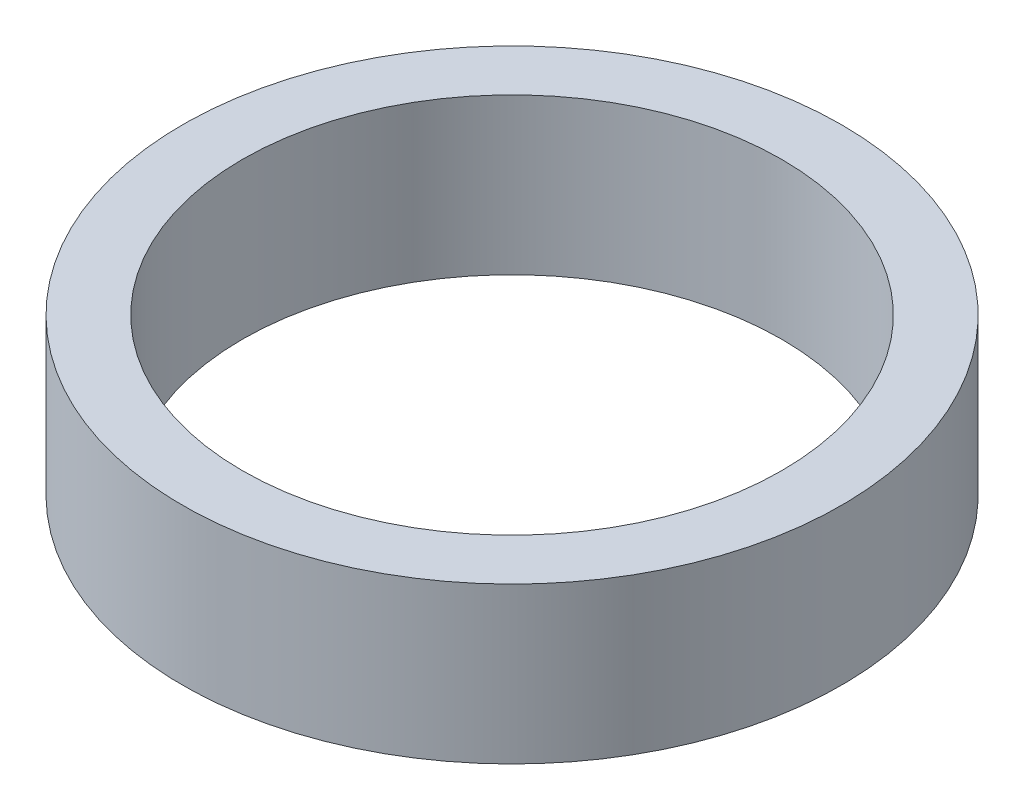
ISO-10303-21;
HEADER;
FILE_DESCRIPTION(('STEP AP214'),'2;1');
FILE_NAME('part.step','',(''),(''),'','','');
FILE_SCHEMA(('AUTOMOTIVE_DESIGN { 1 0 10303 214 1 1 1 1 }'));
ENDSEC;
DATA;
#1=APPLICATION_CONTEXT('core data for automotive mechanical design processes');
#2=APPLICATION_PROTOCOL_DEFINITION('international standard','automotive_design',2000,#1);
#3=PRODUCT_CONTEXT('',#1,'mechanical');
#4=PRODUCT('Part','Part','',(#3));
#5=PRODUCT_RELATED_PRODUCT_CATEGORY('part','',(#4));
#6=PRODUCT_DEFINITION_FORMATION('','',#4);
#7=PRODUCT_DEFINITION_CONTEXT('part definition',#1,'design');
#8=PRODUCT_DEFINITION('design','',#6,#7);
#9=PRODUCT_DEFINITION_SHAPE('','',#8);
#10=(LENGTH_UNIT() NAMED_UNIT(*) SI_UNIT(.MILLI.,.METRE.));
#11=(NAMED_UNIT(*) PLANE_ANGLE_UNIT() SI_UNIT($,.RADIAN.));
#12=(NAMED_UNIT(*) SI_UNIT($,.STERADIAN.) SOLID_ANGLE_UNIT());
#13=UNCERTAINTY_MEASURE_WITH_UNIT(LENGTH_MEASURE(1.E-05),#10,'distance_accuracy_value','');
#14=(GEOMETRIC_REPRESENTATION_CONTEXT(3) GLOBAL_UNCERTAINTY_ASSIGNED_CONTEXT((#13)) GLOBAL_UNIT_ASSIGNED_CONTEXT((#10,
#11,#12)) REPRESENTATION_CONTEXT('',''));
#15=CARTESIAN_POINT('',(0.,0.,0.));
#16=DIRECTION('',(0.,0.,1.));
#17=DIRECTION('',(1.,0.,0.));
#18=AXIS2_PLACEMENT_3D('',#15,#16,#17);
#19=CARTESIAN_POINT('',(0.,26.,0.));
#20=DIRECTION('',(0.,-1.,0.));
#21=DIRECTION('',(0.,0.,-1.));
#22=AXIS2_PLACEMENT_3D('',#19,#20,#21);
#23=CYLINDRICAL_SURFACE('',#22,55.);
#24=CARTESIAN_POINT('',(0.,26.,0.));
#25=DIRECTION('',(0.,1.,0.));
#26=DIRECTION('',(0.,0.,1.));
#27=AXIS2_PLACEMENT_3D('',#24,#25,#26);
#28=CIRCLE('',#27,55.);
#29=CARTESIAN_POINT('',(0.,26.,-55.));
#30=VERTEX_POINT('',#29);
#31=EDGE_CURVE('E10',#30,#30,#28,.T.);
#32=CARTESIAN_POINT('',(0.,0.,0.));
#33=DIRECTION('',(0.,1.,0.));
#34=DIRECTION('',(0.,0.,1.));
#35=AXIS2_PLACEMENT_3D('',#32,#33,#34);
#36=CIRCLE('',#35,55.);
#37=CARTESIAN_POINT('',(0.,0.,-55.));
#38=VERTEX_POINT('',#37);
#39=EDGE_CURVE('E37',#38,#38,#36,.T.);
#40=CARTESIAN_POINT('',(0.,26.,-55.));
#41=CARTESIAN_POINT('',(0.,25.7291666666667,-55.));
#42=CARTESIAN_POINT('',(0.,25.4583333333333,-55.));
#43=CARTESIAN_POINT('',(0.,24.9166666666667,-55.));
#44=CARTESIAN_POINT('',(0.,24.6458333333333,-55.));
#45=CARTESIAN_POINT('',(0.,24.1041666666667,-55.));
#46=CARTESIAN_POINT('',(0.,23.8333333333333,-55.));
#47=CARTESIAN_POINT('',(0.,23.2916666666667,-55.));
#48=CARTESIAN_POINT('',(0.,23.0208333333333,-55.));
#49=CARTESIAN_POINT('',(0.,22.4791666666667,-55.));
#50=CARTESIAN_POINT('',(0.,22.2083333333333,-55.));
#51=CARTESIAN_POINT('',(0.,21.6666666666667,-55.));
#52=CARTESIAN_POINT('',(0.,21.3958333333333,-55.));
#53=CARTESIAN_POINT('',(0.,20.8541666666667,-55.));
#54=CARTESIAN_POINT('',(0.,20.5833333333333,-55.));
#55=CARTESIAN_POINT('',(0.,20.0416666666667,-55.));
#56=CARTESIAN_POINT('',(0.,19.7708333333333,-55.));
#57=CARTESIAN_POINT('',(0.,19.2291666666667,-55.));
#58=CARTESIAN_POINT('',(0.,18.9583333333333,-55.));
#59=CARTESIAN_POINT('',(0.,18.4166666666667,-55.));
#60=CARTESIAN_POINT('',(0.,18.1458333333333,-55.));
#61=CARTESIAN_POINT('',(0.,17.6041666666667,-55.));
#62=CARTESIAN_POINT('',(0.,17.3333333333333,-55.));
#63=CARTESIAN_POINT('',(0.,16.7916666666667,-55.));
#64=CARTESIAN_POINT('',(0.,16.5208333333333,-55.));
#65=CARTESIAN_POINT('',(0.,15.9791666666667,-55.));
#66=CARTESIAN_POINT('',(0.,15.7083333333333,-55.));
#67=CARTESIAN_POINT('',(0.,15.1666666666667,-55.));
#68=CARTESIAN_POINT('',(0.,14.8958333333333,-55.));
#69=CARTESIAN_POINT('',(0.,14.3541666666667,-55.));
#70=CARTESIAN_POINT('',(0.,14.0833333333333,-55.));
#71=CARTESIAN_POINT('',(0.,13.5416666666667,-55.));
#72=CARTESIAN_POINT('',(0.,13.2708333333333,-55.));
#73=CARTESIAN_POINT('',(0.,12.7291666666667,-55.));
#74=CARTESIAN_POINT('',(0.,12.4583333333333,-55.));
#75=CARTESIAN_POINT('',(0.,11.9166666666667,-55.));
#76=CARTESIAN_POINT('',(0.,11.6458333333333,-55.));
#77=CARTESIAN_POINT('',(0.,11.1041666666667,-55.));
#78=CARTESIAN_POINT('',(0.,10.8333333333333,-55.));
#79=CARTESIAN_POINT('',(0.,10.2916666666667,-55.));
#80=CARTESIAN_POINT('',(0.,10.0208333333333,-55.));
#81=CARTESIAN_POINT('',(0.,9.47916666666667,-55.));
#82=CARTESIAN_POINT('',(0.,9.20833333333333,-55.));
#83=CARTESIAN_POINT('',(0.,8.66666666666667,-55.));
#84=CARTESIAN_POINT('',(0.,8.39583333333333,-55.));
#85=CARTESIAN_POINT('',(0.,7.85416666666667,-55.));
#86=CARTESIAN_POINT('',(0.,7.58333333333333,-55.));
#87=CARTESIAN_POINT('',(0.,7.04166666666667,-55.));
#88=CARTESIAN_POINT('',(0.,6.77083333333333,-55.));
#89=CARTESIAN_POINT('',(0.,6.22916666666667,-55.));
#90=CARTESIAN_POINT('',(0.,5.95833333333333,-55.));
#91=CARTESIAN_POINT('',(0.,5.41666666666667,-55.));
#92=CARTESIAN_POINT('',(0.,5.14583333333333,-55.));
#93=CARTESIAN_POINT('',(0.,4.60416666666667,-55.));
#94=CARTESIAN_POINT('',(0.,4.33333333333333,-55.));
#95=CARTESIAN_POINT('',(0.,3.79166666666667,-55.));
#96=CARTESIAN_POINT('',(0.,3.52083333333333,-55.));
#97=CARTESIAN_POINT('',(0.,2.97916666666667,-55.));
#98=CARTESIAN_POINT('',(0.,2.70833333333333,-55.));
#99=CARTESIAN_POINT('',(0.,2.16666666666667,-55.));
#100=CARTESIAN_POINT('',(0.,1.89583333333333,-55.));
#101=CARTESIAN_POINT('',(0.,1.35416666666667,-55.));
#102=CARTESIAN_POINT('',(0.,1.08333333333333,-55.));
#103=CARTESIAN_POINT('',(0.,0.541666666666667,-55.));
#104=CARTESIAN_POINT('',(0.,0.270833333333334,-55.));
#105=CARTESIAN_POINT('',(0.,0.,-55.));
#106=B_SPLINE_CURVE_WITH_KNOTS('',3,(#40,#41,#42,#43,#44,#45,#46,#47,#48,#49,#50,#51,#52,#53,
#54,#55,#56,#57,#58,#59,#60,#61,#62,#63,#64,#65,#66,#67,#68,#69,#70,#71,#72,#73,#74,#75,#76,#77,
#78,#79,#80,#81,#82,#83,#84,#85,#86,#87,#88,#89,#90,#91,#92,#93,#94,#95,#96,#97,#98,#99,#100,
#101,#102,#103,#104,#105),.UNSPECIFIED.,.F.,.F.,(4,2,2,2,2,2,2,2,2,2,2,2,2,2,2,2,2,2,2,2,2,2,2,
2,2,2,2,2,2,2,2,2,4),(0.,0.812500000000001,1.625,2.4375,3.25,4.0625,4.875,5.6875,6.5,7.3125,
8.125,8.9375,9.75,10.5625,11.375,12.1875,13.,13.8125,14.625,15.4375,16.25,17.0625,17.875,
18.6875,19.5,20.3125,21.125,21.9375,22.75,23.5625,24.375,25.1875,26.),.UNSPECIFIED.);
#107=EDGE_CURVE('BSEAM40',#30,#38,#106,.T.);
#108=ORIENTED_EDGE('',*,*,#31,.F.);
#109=ORIENTED_EDGE('',*,*,#39,.T.);
#110=ORIENTED_EDGE('',*,*,#107,.T.);
#111=ORIENTED_EDGE('',*,*,#107,.F.);
#112=EDGE_LOOP('',(#108,#110,#109,#111));
#113=FACE_BOUND('',#112,.T.);
#114=ADVANCED_FACE('F40',(#113),#23,.T.);
#115=CARTESIAN_POINT('',(0.,26.,0.));
#116=DIRECTION('',(0.,1.,0.));
#117=DIRECTION('',(0.,0.,1.));
#118=AXIS2_PLACEMENT_3D('',#115,#116,#117);
#119=PLANE('',#118);
#120=CARTESIAN_POINT('',(0.,26.,0.));
#121=DIRECTION('',(0.,1.,0.));
#122=DIRECTION('',(0.,0.,1.));
#123=AXIS2_PLACEMENT_3D('',#120,#121,#122);
#124=CIRCLE('',#123,45.);
#125=CARTESIAN_POINT('',(0.,26.,-45.));
#126=VERTEX_POINT('',#125);
#127=EDGE_CURVE('E50',#126,#126,#124,.T.);
#128=ORIENTED_EDGE('',*,*,#127,.F.);
#129=EDGE_LOOP('',(#128));
#130=FACE_BOUND('',#129,.T.);
#131=ORIENTED_EDGE('',*,*,#31,.T.);
#132=EDGE_LOOP('',(#131));
#133=FACE_BOUND('',#132,.T.);
#134=ADVANCED_FACE('F59',(#130,#133),#119,.T.);
#135=CARTESIAN_POINT('',(0.,0.,0.));
#136=DIRECTION('',(0.,1.,0.));
#137=DIRECTION('',(0.,0.,1.));
#138=AXIS2_PLACEMENT_3D('',#135,#136,#137);
#139=PLANE('',#138);
#140=CARTESIAN_POINT('',(0.,0.,0.));
#141=DIRECTION('',(0.,1.,0.));
#142=DIRECTION('',(0.,0.,1.));
#143=AXIS2_PLACEMENT_3D('',#140,#141,#142);
#144=CIRCLE('',#143,45.);
#145=CARTESIAN_POINT('',(0.,0.,-45.));
#146=VERTEX_POINT('',#145);
#147=EDGE_CURVE('E47',#146,#146,#144,.T.);
#148=ORIENTED_EDGE('',*,*,#147,.T.);
#149=EDGE_LOOP('',(#148));
#150=FACE_BOUND('',#149,.T.);
#151=ORIENTED_EDGE('',*,*,#39,.F.);
#152=EDGE_LOOP('',(#151));
#153=FACE_BOUND('',#152,.T.);
#154=ADVANCED_FACE('F58',(#150,#153),#139,.F.);
#155=CARTESIAN_POINT('',(0.,26.,0.));
#156=DIRECTION('',(0.,-1.,0.));
#157=DIRECTION('',(0.,0.,-1.));
#158=AXIS2_PLACEMENT_3D('',#155,#156,#157);
#159=CYLINDRICAL_SURFACE('',#158,45.);
#160=CARTESIAN_POINT('',(0.,26.,-45.));
#161=CARTESIAN_POINT('',(0.,25.7291666666667,-45.));
#162=CARTESIAN_POINT('',(0.,25.4583333333333,-45.));
#163=CARTESIAN_POINT('',(0.,24.9166666666667,-45.));
#164=CARTESIAN_POINT('',(0.,24.6458333333333,-45.));
#165=CARTESIAN_POINT('',(0.,24.1041666666667,-45.));
#166=CARTESIAN_POINT('',(0.,23.8333333333333,-45.));
#167=CARTESIAN_POINT('',(0.,23.2916666666667,-45.));
#168=CARTESIAN_POINT('',(0.,23.0208333333333,-45.));
#169=CARTESIAN_POINT('',(0.,22.4791666666667,-45.));
#170=CARTESIAN_POINT('',(0.,22.2083333333333,-45.));
#171=CARTESIAN_POINT('',(0.,21.6666666666667,-45.));
#172=CARTESIAN_POINT('',(0.,21.3958333333333,-45.));
#173=CARTESIAN_POINT('',(0.,20.8541666666667,-45.));
#174=CARTESIAN_POINT('',(0.,20.5833333333333,-45.));
#175=CARTESIAN_POINT('',(0.,20.0416666666667,-45.));
#176=CARTESIAN_POINT('',(0.,19.7708333333333,-45.));
#177=CARTESIAN_POINT('',(0.,19.2291666666667,-45.));
#178=CARTESIAN_POINT('',(0.,18.9583333333333,-45.));
#179=CARTESIAN_POINT('',(0.,18.4166666666667,-45.));
#180=CARTESIAN_POINT('',(0.,18.1458333333333,-45.));
#181=CARTESIAN_POINT('',(0.,17.6041666666667,-45.));
#182=CARTESIAN_POINT('',(0.,17.3333333333333,-45.));
#183=CARTESIAN_POINT('',(0.,16.7916666666667,-45.));
#184=CARTESIAN_POINT('',(0.,16.5208333333333,-45.));
#185=CARTESIAN_POINT('',(0.,15.9791666666667,-45.));
#186=CARTESIAN_POINT('',(0.,15.7083333333333,-45.));
#187=CARTESIAN_POINT('',(0.,15.1666666666667,-45.));
#188=CARTESIAN_POINT('',(0.,14.8958333333333,-45.));
#189=CARTESIAN_POINT('',(0.,14.3541666666667,-45.));
#190=CARTESIAN_POINT('',(0.,14.0833333333333,-45.));
#191=CARTESIAN_POINT('',(0.,13.5416666666667,-45.));
#192=CARTESIAN_POINT('',(0.,13.2708333333333,-45.));
#193=CARTESIAN_POINT('',(0.,12.7291666666667,-45.));
#194=CARTESIAN_POINT('',(0.,12.4583333333333,-45.));
#195=CARTESIAN_POINT('',(0.,11.9166666666667,-45.));
#196=CARTESIAN_POINT('',(0.,11.6458333333333,-45.));
#197=CARTESIAN_POINT('',(0.,11.1041666666667,-45.));
#198=CARTESIAN_POINT('',(0.,10.8333333333333,-45.));
#199=CARTESIAN_POINT('',(0.,10.2916666666667,-45.));
#200=CARTESIAN_POINT('',(0.,10.0208333333333,-45.));
#201=CARTESIAN_POINT('',(0.,9.47916666666667,-45.));
#202=CARTESIAN_POINT('',(0.,9.20833333333333,-45.));
#203=CARTESIAN_POINT('',(0.,8.66666666666667,-45.));
#204=CARTESIAN_POINT('',(0.,8.39583333333333,-45.));
#205=CARTESIAN_POINT('',(0.,7.85416666666667,-45.));
#206=CARTESIAN_POINT('',(0.,7.58333333333333,-45.));
#207=CARTESIAN_POINT('',(0.,7.04166666666667,-45.));
#208=CARTESIAN_POINT('',(0.,6.77083333333333,-45.));
#209=CARTESIAN_POINT('',(0.,6.22916666666667,-45.));
#210=CARTESIAN_POINT('',(0.,5.95833333333333,-45.));
#211=CARTESIAN_POINT('',(0.,5.41666666666667,-45.));
#212=CARTESIAN_POINT('',(0.,5.14583333333333,-45.));
#213=CARTESIAN_POINT('',(0.,4.60416666666667,-45.));
#214=CARTESIAN_POINT('',(0.,4.33333333333333,-45.));
#215=CARTESIAN_POINT('',(0.,3.79166666666667,-45.));
#216=CARTESIAN_POINT('',(0.,3.52083333333333,-45.));
#217=CARTESIAN_POINT('',(0.,2.97916666666667,-45.));
#218=CARTESIAN_POINT('',(0.,2.70833333333333,-45.));
#219=CARTESIAN_POINT('',(0.,2.16666666666667,-45.));
#220=CARTESIAN_POINT('',(0.,1.89583333333333,-45.));
#221=CARTESIAN_POINT('',(0.,1.35416666666667,-45.));
#222=CARTESIAN_POINT('',(0.,1.08333333333333,-45.));
#223=CARTESIAN_POINT('',(0.,0.541666666666667,-45.));
#224=CARTESIAN_POINT('',(0.,0.270833333333334,-45.));
#225=CARTESIAN_POINT('',(0.,0.,-45.));
#226=B_SPLINE_CURVE_WITH_KNOTS('',3,(#160,#161,#162,#163,#164,#165,#166,#167,#168,#169,#170,
#171,#172,#173,#174,#175,#176,#177,#178,#179,#180,#181,#182,#183,#184,#185,#186,#187,#188,#189,
#190,#191,#192,#193,#194,#195,#196,#197,#198,#199,#200,#201,#202,#203,#204,#205,#206,#207,#208,
#209,#210,#211,#212,#213,#214,#215,#216,#217,#218,#219,#220,#221,#222,#223,#224,#225),
.UNSPECIFIED.,.F.,.F.,(4,2,2,2,2,2,2,2,2,2,2,2,2,2,2,2,2,2,2,2,2,2,2,2,2,2,2,2,2,2,2,2,4),(0.,
0.812499999999997,1.625,2.4375,3.25,4.0625,4.875,5.6875,6.5,7.3125,8.125,8.93749999999999,
9.74999999999999,10.5625,11.375,12.1875,13.,13.8125,14.625,15.4375,16.25,17.0625,17.875,18.6875,
19.5,20.3125,21.125,21.9375,22.75,23.5625,24.375,25.1875,26.),.UNSPECIFIED.);
#227=EDGE_CURVE('BSEAM54',#126,#146,#226,.T.);
#228=ORIENTED_EDGE('',*,*,#127,.T.);
#229=ORIENTED_EDGE('',*,*,#147,.F.);
#230=ORIENTED_EDGE('',*,*,#227,.T.);
#231=ORIENTED_EDGE('',*,*,#227,.F.);
#232=EDGE_LOOP('',(#228,#230,#229,#231));
#233=FACE_BOUND('',#232,.T.);
#234=ADVANCED_FACE('F54',(#233),#159,.F.);
#235=CLOSED_SHELL('',(#114,#134,#154,#234));
#236=MANIFOLD_SOLID_BREP('B2',#235);
#237=ADVANCED_BREP_SHAPE_REPRESENTATION('',(#18,#236),#14);
#238=SHAPE_DEFINITION_REPRESENTATION(#9,#237);
ENDSEC;
END-ISO-10303-21;
